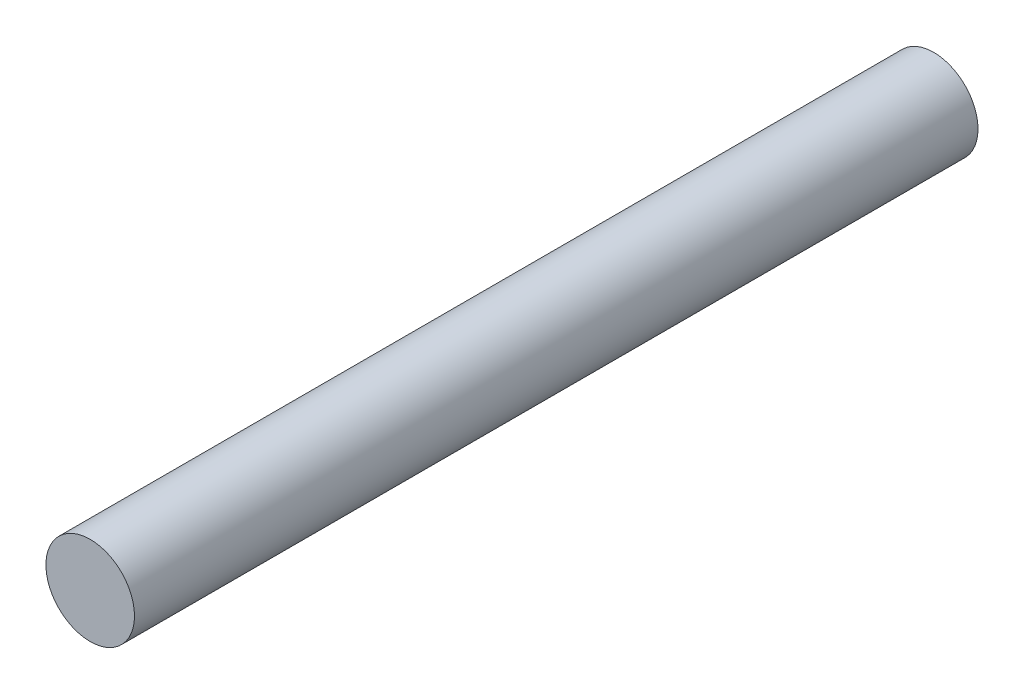
ISO-10303-21;
HEADER;
FILE_DESCRIPTION(('STEP AP214'),'2;1');
FILE_NAME('part.step','',(''),(''),'','','');
FILE_SCHEMA(('AUTOMOTIVE_DESIGN { 1 0 10303 214 1 1 1 1 }'));
ENDSEC;
DATA;
#1=APPLICATION_CONTEXT('core data for automotive mechanical design processes');
#2=APPLICATION_PROTOCOL_DEFINITION('international standard','automotive_design',2000,#1);
#3=PRODUCT_CONTEXT('',#1,'mechanical');
#4=PRODUCT('Part','Part','',(#3));
#5=PRODUCT_RELATED_PRODUCT_CATEGORY('part','',(#4));
#6=PRODUCT_DEFINITION_FORMATION('','',#4);
#7=PRODUCT_DEFINITION_CONTEXT('part definition',#1,'design');
#8=PRODUCT_DEFINITION('design','',#6,#7);
#9=PRODUCT_DEFINITION_SHAPE('','',#8);
#10=(LENGTH_UNIT() NAMED_UNIT(*) SI_UNIT(.MILLI.,.METRE.));
#11=(NAMED_UNIT(*) PLANE_ANGLE_UNIT() SI_UNIT($,.RADIAN.));
#12=(NAMED_UNIT(*) SI_UNIT($,.STERADIAN.) SOLID_ANGLE_UNIT());
#13=UNCERTAINTY_MEASURE_WITH_UNIT(LENGTH_MEASURE(1.E-05),#10,'distance_accuracy_value','');
#14=(GEOMETRIC_REPRESENTATION_CONTEXT(3) GLOBAL_UNCERTAINTY_ASSIGNED_CONTEXT((#13)) GLOBAL_UNIT_ASSIGNED_CONTEXT((#10,
#11,#12)) REPRESENTATION_CONTEXT('',''));
#15=CARTESIAN_POINT('',(0.,0.,0.));
#16=DIRECTION('',(0.,0.,1.));
#17=DIRECTION('',(1.,0.,0.));
#18=AXIS2_PLACEMENT_3D('',#15,#16,#17);
#19=CARTESIAN_POINT('',(0.,0.,20.));
#20=DIRECTION('',(0.,0.,-1.));
#21=DIRECTION('',(-1.,0.,0.));
#22=AXIS2_PLACEMENT_3D('',#19,#20,#21);
#23=CYLINDRICAL_SURFACE('',#22,1.05);
#24=CARTESIAN_POINT('',(0.,0.,20.));
#25=DIRECTION('',(0.,0.,1.));
#26=DIRECTION('',(1.,0.,0.));
#27=AXIS2_PLACEMENT_3D('',#24,#25,#26);
#28=CIRCLE('',#27,1.05);
#29=CARTESIAN_POINT('',(1.05,0.,20.));
#30=VERTEX_POINT('',#29);
#31=EDGE_CURVE('E10',#30,#30,#28,.T.);
#32=ORIENTED_EDGE('',*,*,#31,.F.);
#33=EDGE_LOOP('',(#32));
#34=FACE_BOUND('',#33,.T.);
#35=CARTESIAN_POINT('',(0.,0.,0.));
#36=DIRECTION('',(0.,0.,1.));
#37=DIRECTION('',(1.,0.,0.));
#38=AXIS2_PLACEMENT_3D('',#35,#36,#37);
#39=CIRCLE('',#38,1.05);
#40=CARTESIAN_POINT('',(1.05,0.,0.));
#41=VERTEX_POINT('',#40);
#42=EDGE_CURVE('E33',#41,#41,#39,.T.);
#43=ORIENTED_EDGE('',*,*,#42,.T.);
#44=EDGE_LOOP('',(#43));
#45=FACE_BOUND('',#44,.T.);
#46=ADVANCED_FACE('F30',(#34,#45),#23,.T.);
#47=CARTESIAN_POINT('',(0.,0.,20.));
#48=DIRECTION('',(0.,0.,1.));
#49=DIRECTION('',(1.,0.,0.));
#50=AXIS2_PLACEMENT_3D('',#47,#48,#49);
#51=PLANE('',#50);
#52=ORIENTED_EDGE('',*,*,#31,.T.);
#53=EDGE_LOOP('',(#52));
#54=FACE_BOUND('',#53,.T.);
#55=ADVANCED_FACE('F45',(#54),#51,.T.);
#56=CARTESIAN_POINT('',(0.,0.,0.));
#57=DIRECTION('',(0.,0.,1.));
#58=DIRECTION('',(1.,0.,0.));
#59=AXIS2_PLACEMENT_3D('',#56,#57,#58);
#60=PLANE('',#59);
#61=ORIENTED_EDGE('',*,*,#42,.F.);
#62=EDGE_LOOP('',(#61));
#63=FACE_BOUND('',#62,.T.);
#64=ADVANCED_FACE('F43',(#63),#60,.F.);
#65=CLOSED_SHELL('',(#46,#55,#64));
#66=MANIFOLD_SOLID_BREP('B2',#65);
#67=ADVANCED_BREP_SHAPE_REPRESENTATION('',(#18,#66),#14);
#68=SHAPE_DEFINITION_REPRESENTATION(#9,#67);
ENDSEC;
END-ISO-10303-21;
